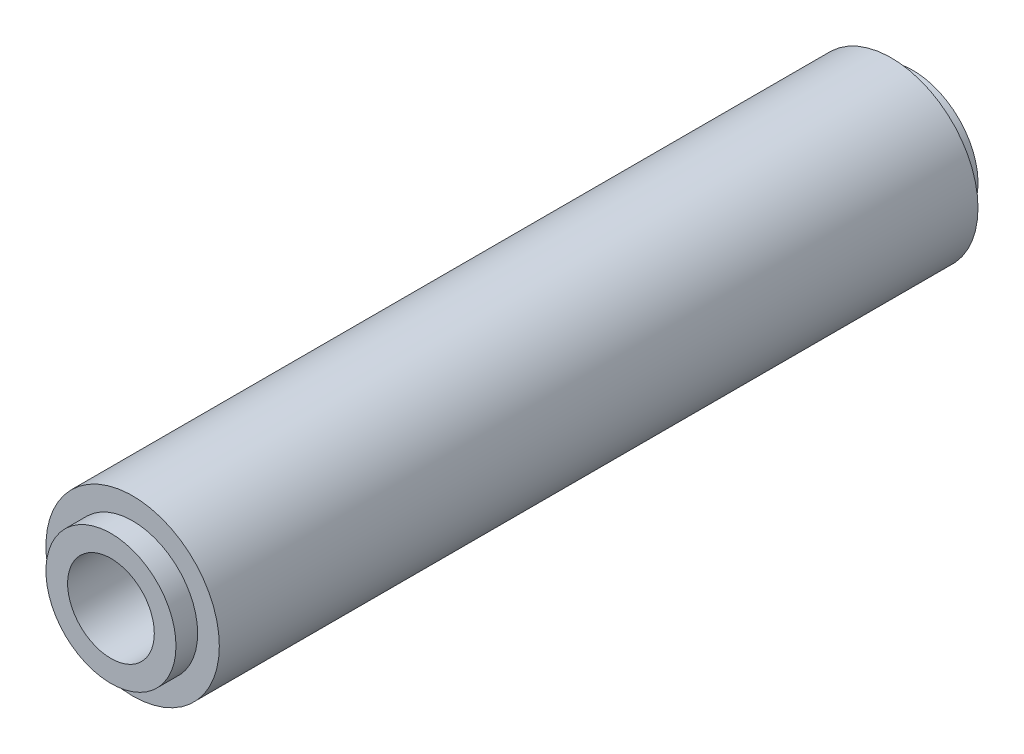
ISO-10303-21;
HEADER;
FILE_DESCRIPTION(('STEP AP214'),'2;1');
FILE_NAME('part.step','',(''),(''),'','','');
FILE_SCHEMA(('AUTOMOTIVE_DESIGN { 1 0 10303 214 1 1 1 1 }'));
ENDSEC;
DATA;
#1=APPLICATION_CONTEXT('core data for automotive mechanical design processes');
#2=APPLICATION_PROTOCOL_DEFINITION('international standard','automotive_design',2000,#1);
#3=PRODUCT_CONTEXT('',#1,'mechanical');
#4=PRODUCT('Part','Part','',(#3));
#5=PRODUCT_RELATED_PRODUCT_CATEGORY('part','',(#4));
#6=PRODUCT_DEFINITION_FORMATION('','',#4);
#7=PRODUCT_DEFINITION_CONTEXT('part definition',#1,'design');
#8=PRODUCT_DEFINITION('design','',#6,#7);
#9=PRODUCT_DEFINITION_SHAPE('','',#8);
#10=(LENGTH_UNIT() NAMED_UNIT(*) SI_UNIT(.MILLI.,.METRE.));
#11=(NAMED_UNIT(*) PLANE_ANGLE_UNIT() SI_UNIT($,.RADIAN.));
#12=(NAMED_UNIT(*) SI_UNIT($,.STERADIAN.) SOLID_ANGLE_UNIT());
#13=UNCERTAINTY_MEASURE_WITH_UNIT(LENGTH_MEASURE(1.E-05),#10,'distance_accuracy_value','');
#14=(GEOMETRIC_REPRESENTATION_CONTEXT(3) GLOBAL_UNCERTAINTY_ASSIGNED_CONTEXT((#13)) GLOBAL_UNIT_ASSIGNED_CONTEXT((#10,
#11,#12)) REPRESENTATION_CONTEXT('',''));
#15=CARTESIAN_POINT('',(0.,0.,0.));
#16=DIRECTION('',(0.,0.,1.));
#17=DIRECTION('',(1.,0.,0.));
#18=AXIS2_PLACEMENT_3D('',#15,#16,#17);
#19=CARTESIAN_POINT('',(0.,0.,-29.36875));
#20=DIRECTION('',(0.,0.,-1.));
#21=DIRECTION('',(0.,-1.,0.));
#22=AXIS2_PLACEMENT_3D('',#19,#20,#21);
#23=CYLINDRICAL_SURFACE('',#22,4.7625);
#24=CARTESIAN_POINT('',(0.,0.,-27.78125));
#25=DIRECTION('',(0.,0.,1.));
#26=DIRECTION('',(1.,0.,0.));
#27=AXIS2_PLACEMENT_3D('',#24,#25,#26);
#28=CIRCLE('',#27,4.7625);
#29=CARTESIAN_POINT('',(4.7625,0.,-27.78125));
#30=VERTEX_POINT('',#29);
#31=EDGE_CURVE('E8',#30,#30,#28,.T.);
#32=ORIENTED_EDGE('',*,*,#31,.F.);
#33=EDGE_LOOP('',(#32));
#34=FACE_BOUND('',#33,.T.);
#35=CARTESIAN_POINT('',(0.,0.,-29.36875));
#36=DIRECTION('',(0.,0.,-1.));
#37=DIRECTION('',(0.,-1.,0.));
#38=AXIS2_PLACEMENT_3D('',#35,#36,#37);
#39=CIRCLE('',#38,4.7625);
#40=CARTESIAN_POINT('',(0.,-4.7625,-29.36875));
#41=VERTEX_POINT('',#40);
#42=EDGE_CURVE('E26',#41,#41,#39,.T.);
#43=ORIENTED_EDGE('',*,*,#42,.F.);
#44=EDGE_LOOP('',(#43));
#45=FACE_BOUND('',#44,.T.);
#46=ADVANCED_FACE('F13',(#34,#45),#23,.T.);
#47=CARTESIAN_POINT('',(0.,0.,-27.78125));
#48=DIRECTION('',(0.,0.,1.));
#49=DIRECTION('',(1.,0.,0.));
#50=AXIS2_PLACEMENT_3D('',#47,#48,#49);
#51=PLANE('',#50);
#52=ORIENTED_EDGE('',*,*,#31,.T.);
#53=EDGE_LOOP('',(#52));
#54=FACE_BOUND('',#53,.T.);
#55=CARTESIAN_POINT('',(0.,0.,-27.78125));
#56=DIRECTION('',(0.,0.,1.));
#57=DIRECTION('',(1.,0.,0.));
#58=AXIS2_PLACEMENT_3D('',#55,#56,#57);
#59=CIRCLE('',#58,6.35);
#60=CARTESIAN_POINT('',(6.35,0.,-27.78125));
#61=VERTEX_POINT('',#60);
#62=EDGE_CURVE('E32',#61,#61,#59,.T.);
#63=ORIENTED_EDGE('',*,*,#62,.F.);
#64=EDGE_LOOP('',(#63));
#65=FACE_BOUND('',#64,.T.);
#66=ADVANCED_FACE('F64',(#54,#65),#51,.F.);
#67=CARTESIAN_POINT('',(0.,0.,29.36875));
#68=DIRECTION('',(0.,0.,-1.));
#69=DIRECTION('',(0.,-1.,0.));
#70=AXIS2_PLACEMENT_3D('',#67,#68,#69);
#71=CYLINDRICAL_SURFACE('',#70,4.7625);
#72=CARTESIAN_POINT('',(0.,0.,27.78125));
#73=DIRECTION('',(0.,0.,1.));
#74=DIRECTION('',(1.,0.,0.));
#75=AXIS2_PLACEMENT_3D('',#72,#73,#74);
#76=CIRCLE('',#75,4.7625);
#77=CARTESIAN_POINT('',(4.7625,0.,27.78125));
#78=VERTEX_POINT('',#77);
#79=EDGE_CURVE('E21',#78,#78,#76,.T.);
#80=ORIENTED_EDGE('',*,*,#79,.T.);
#81=EDGE_LOOP('',(#80));
#82=FACE_BOUND('',#81,.T.);
#83=CARTESIAN_POINT('',(0.,0.,29.36875));
#84=DIRECTION('',(0.,0.,1.));
#85=DIRECTION('',(1.,0.,0.));
#86=AXIS2_PLACEMENT_3D('',#83,#84,#85);
#87=CIRCLE('',#86,4.7625);
#88=CARTESIAN_POINT('',(4.7625,0.,29.36875));
#89=VERTEX_POINT('',#88);
#90=EDGE_CURVE('E36',#89,#89,#87,.T.);
#91=ORIENTED_EDGE('',*,*,#90,.F.);
#92=EDGE_LOOP('',(#91));
#93=FACE_BOUND('',#92,.T.);
#94=ADVANCED_FACE('F70',(#82,#93),#71,.T.);
#95=CARTESIAN_POINT('',(0.,0.,27.78125));
#96=DIRECTION('',(0.,0.,-1.));
#97=DIRECTION('',(-1.,0.,0.));
#98=AXIS2_PLACEMENT_3D('',#95,#96,#97);
#99=PLANE('',#98);
#100=ORIENTED_EDGE('',*,*,#79,.F.);
#101=EDGE_LOOP('',(#100));
#102=FACE_BOUND('',#101,.T.);
#103=CARTESIAN_POINT('',(0.,0.,27.78125));
#104=DIRECTION('',(0.,0.,-1.));
#105=DIRECTION('',(0.,-1.,0.));
#106=AXIS2_PLACEMENT_3D('',#103,#104,#105);
#107=CIRCLE('',#106,6.35);
#108=CARTESIAN_POINT('',(0.,-6.35,27.78125));
#109=VERTEX_POINT('',#108);
#110=EDGE_CURVE('E34',#109,#109,#107,.T.);
#111=ORIENTED_EDGE('',*,*,#110,.F.);
#112=EDGE_LOOP('',(#111));
#113=FACE_BOUND('',#112,.T.);
#114=ADVANCED_FACE('F48',(#102,#113),#99,.F.);
#115=CARTESIAN_POINT('',(0.,0.,0.));
#116=DIRECTION('',(0.,0.,1.));
#117=DIRECTION('',(1.,0.,0.));
#118=AXIS2_PLACEMENT_3D('',#115,#116,#117);
#119=CYLINDRICAL_SURFACE('',#118,3.175);
#120=CARTESIAN_POINT('',(0.,0.,-29.36875));
#121=DIRECTION('',(0.,0.,1.));
#122=DIRECTION('',(1.,0.,0.));
#123=AXIS2_PLACEMENT_3D('',#120,#121,#122);
#124=CIRCLE('',#123,3.175);
#125=CARTESIAN_POINT('',(3.175,0.,-29.36875));
#126=VERTEX_POINT('',#125);
#127=EDGE_CURVE('E31',#126,#126,#124,.T.);
#128=ORIENTED_EDGE('',*,*,#127,.F.);
#129=EDGE_LOOP('',(#128));
#130=FACE_BOUND('',#129,.T.);
#131=CARTESIAN_POINT('',(0.,0.,29.36875));
#132=DIRECTION('',(0.,0.,-1.));
#133=DIRECTION('',(0.,-1.,0.));
#134=AXIS2_PLACEMENT_3D('',#131,#132,#133);
#135=CIRCLE('',#134,3.175);
#136=CARTESIAN_POINT('',(0.,-3.175,29.36875));
#137=VERTEX_POINT('',#136);
#138=EDGE_CURVE('E17',#137,#137,#135,.T.);
#139=ORIENTED_EDGE('',*,*,#138,.F.);
#140=EDGE_LOOP('',(#139));
#141=FACE_BOUND('',#140,.T.);
#142=ADVANCED_FACE('F45',(#130,#141),#119,.F.);
#143=CARTESIAN_POINT('',(0.,0.,-29.36875));
#144=DIRECTION('',(0.,0.,-1.));
#145=DIRECTION('',(-1.,0.,0.));
#146=AXIS2_PLACEMENT_3D('',#143,#144,#145);
#147=PLANE('',#146);
#148=ORIENTED_EDGE('',*,*,#42,.T.);
#149=EDGE_LOOP('',(#148));
#150=FACE_BOUND('',#149,.T.);
#151=ORIENTED_EDGE('',*,*,#127,.T.);
#152=EDGE_LOOP('',(#151));
#153=FACE_BOUND('',#152,.T.);
#154=ADVANCED_FACE('F43',(#150,#153),#147,.T.);
#155=CARTESIAN_POINT('',(0.,0.,0.));
#156=DIRECTION('',(0.,0.,1.));
#157=DIRECTION('',(1.,0.,0.));
#158=AXIS2_PLACEMENT_3D('',#155,#156,#157);
#159=CYLINDRICAL_SURFACE('',#158,6.35);
#160=ORIENTED_EDGE('',*,*,#62,.T.);
#161=EDGE_LOOP('',(#160));
#162=FACE_BOUND('',#161,.T.);
#163=ORIENTED_EDGE('',*,*,#110,.T.);
#164=EDGE_LOOP('',(#163));
#165=FACE_BOUND('',#164,.T.);
#166=ADVANCED_FACE('F15',(#162,#165),#159,.T.);
#167=CARTESIAN_POINT('',(0.,0.,29.36875));
#168=DIRECTION('',(0.,0.,-1.));
#169=DIRECTION('',(-1.,0.,0.));
#170=AXIS2_PLACEMENT_3D('',#167,#168,#169);
#171=PLANE('',#170);
#172=ORIENTED_EDGE('',*,*,#90,.T.);
#173=EDGE_LOOP('',(#172));
#174=FACE_BOUND('',#173,.T.);
#175=ORIENTED_EDGE('',*,*,#138,.T.);
#176=EDGE_LOOP('',(#175));
#177=FACE_BOUND('',#176,.T.);
#178=ADVANCED_FACE('F52',(#174,#177),#171,.F.);
#179=CLOSED_SHELL('',(#46,#66,#94,#114,#142,#154,#166,#178));
#180=MANIFOLD_SOLID_BREP('B1',#179);
#181=ADVANCED_BREP_SHAPE_REPRESENTATION('',(#18,#180),#14);
#182=SHAPE_DEFINITION_REPRESENTATION(#9,#181);
ENDSEC;
END-ISO-10303-21;
